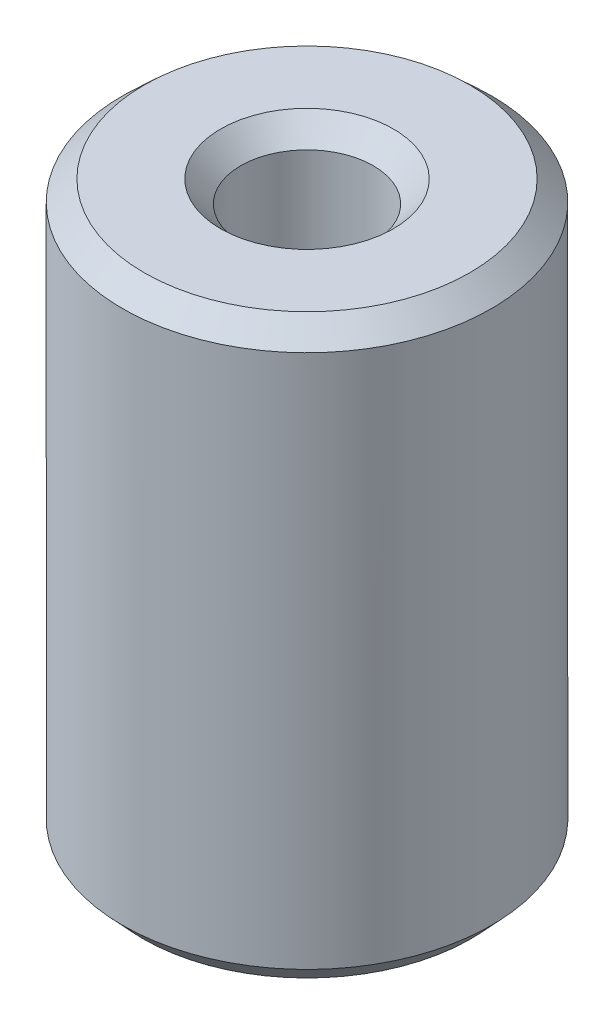
ISO-10303-21;
HEADER;
FILE_DESCRIPTION(('STEP AP214'),'2;1');
FILE_NAME('part.step','',(''),(''),'','','');
FILE_SCHEMA(('AUTOMOTIVE_DESIGN { 1 0 10303 214 1 1 1 1 }'));
ENDSEC;
DATA;
#1=APPLICATION_CONTEXT('core data for automotive mechanical design processes');
#2=APPLICATION_PROTOCOL_DEFINITION('international standard','automotive_design',2000,#1);
#3=PRODUCT_CONTEXT('',#1,'mechanical');
#4=PRODUCT('Part','Part','',(#3));
#5=PRODUCT_RELATED_PRODUCT_CATEGORY('part','',(#4));
#6=PRODUCT_DEFINITION_FORMATION('','',#4);
#7=PRODUCT_DEFINITION_CONTEXT('part definition',#1,'design');
#8=PRODUCT_DEFINITION('design','',#6,#7);
#9=PRODUCT_DEFINITION_SHAPE('','',#8);
#10=(LENGTH_UNIT() NAMED_UNIT(*) SI_UNIT(.MILLI.,.METRE.));
#11=(NAMED_UNIT(*) PLANE_ANGLE_UNIT() SI_UNIT($,.RADIAN.));
#12=(NAMED_UNIT(*) SI_UNIT($,.STERADIAN.) SOLID_ANGLE_UNIT());
#13=UNCERTAINTY_MEASURE_WITH_UNIT(LENGTH_MEASURE(1.E-05),#10,'distance_accuracy_value','');
#14=(GEOMETRIC_REPRESENTATION_CONTEXT(3) GLOBAL_UNCERTAINTY_ASSIGNED_CONTEXT((#13)) GLOBAL_UNIT_ASSIGNED_CONTEXT((#10,
#11,#12)) REPRESENTATION_CONTEXT('',''));
#15=CARTESIAN_POINT('',(0.,0.,0.));
#16=DIRECTION('',(0.,0.,1.));
#17=DIRECTION('',(1.,0.,0.));
#18=AXIS2_PLACEMENT_3D('',#15,#16,#17);
#19=CARTESIAN_POINT('',(0.,46.8487464571703,0.));
#20=DIRECTION('',(0.,-1.,0.));
#21=DIRECTION('',(0.,0.,-1.));
#22=AXIS2_PLACEMENT_3D('',#19,#20,#21);
#23=CYLINDRICAL_SURFACE('',#22,15.);
#24=CARTESIAN_POINT('',(0.,1.76424262891318,0.));
#25=DIRECTION('',(0.,1.,0.));
#26=DIRECTION('',(0.,0.,1.));
#27=AXIS2_PLACEMENT_3D('',#24,#25,#26);
#28=CIRCLE('',#27,15.);
#29=CARTESIAN_POINT('',(0.,1.76424262891318,-15.));
#30=VERTEX_POINT('',#29);
#31=EDGE_CURVE('E10',#30,#30,#28,.T.);
#32=CARTESIAN_POINT('',(0.,45.2051469641876,0.));
#33=DIRECTION('',(0.,1.,0.));
#34=DIRECTION('',(0.,0.,1.));
#35=AXIS2_PLACEMENT_3D('',#32,#33,#34);
#36=CIRCLE('',#35,15.);
#37=CARTESIAN_POINT('',(0.,45.2051469641876,-15.));
#38=VERTEX_POINT('',#37);
#39=EDGE_CURVE('E50',#38,#38,#36,.F.);
#40=CARTESIAN_POINT('',(0.,1.76424262891318,-15.));
#41=CARTESIAN_POINT('',(0.,2.21675204907228,-15.));
#42=CARTESIAN_POINT('',(0.,2.66926146923139,-15.));
#43=CARTESIAN_POINT('',(0.,3.57428030954961,-15.));
#44=CARTESIAN_POINT('',(0.,4.02678972970872,-15.));
#45=CARTESIAN_POINT('',(0.,4.93180857002694,-15.));
#46=CARTESIAN_POINT('',(0.,5.38431799018605,-15.));
#47=CARTESIAN_POINT('',(0.,6.28933683050427,-15.));
#48=CARTESIAN_POINT('',(0.,6.74184625066338,-15.));
#49=CARTESIAN_POINT('',(0.,7.6468650909816,-15.));
#50=CARTESIAN_POINT('',(0.,8.0993745111407,-15.));
#51=CARTESIAN_POINT('',(0.,9.00439335145892,-15.));
#52=CARTESIAN_POINT('',(0.,9.45690277161803,-15.));
#53=CARTESIAN_POINT('',(0.,10.3619216119362,-15.));
#54=CARTESIAN_POINT('',(0.,10.8144310320954,-15.));
#55=CARTESIAN_POINT('',(0.,11.7194498724136,-15.));
#56=CARTESIAN_POINT('',(0.,12.1719592925727,-15.));
#57=CARTESIAN_POINT('',(0.,13.0769781328909,-15.));
#58=CARTESIAN_POINT('',(0.,13.52948755305,-15.));
#59=CARTESIAN_POINT('',(0.,14.4345063933682,-15.));
#60=CARTESIAN_POINT('',(0.,14.8870158135273,-15.));
#61=CARTESIAN_POINT('',(0.,15.7920346538456,-15.));
#62=CARTESIAN_POINT('',(0.,16.2445440740047,-15.));
#63=CARTESIAN_POINT('',(0.,17.1495629143229,-15.));
#64=CARTESIAN_POINT('',(0.,17.602072334482,-15.));
#65=CARTESIAN_POINT('',(0.,18.5070911748002,-15.));
#66=CARTESIAN_POINT('',(0.,18.9596005949593,-15.));
#67=CARTESIAN_POINT('',(0.,19.8646194352775,-15.));
#68=CARTESIAN_POINT('',(0.,20.3171288554366,-15.));
#69=CARTESIAN_POINT('',(0.,21.2221476957549,-15.));
#70=CARTESIAN_POINT('',(0.,21.674657115914,-15.));
#71=CARTESIAN_POINT('',(0.,22.5796759562322,-15.));
#72=CARTESIAN_POINT('',(0.,23.0321853763913,-15.));
#73=CARTESIAN_POINT('',(0.,23.9372042167095,-15.));
#74=CARTESIAN_POINT('',(0.,24.3897136368686,-15.));
#75=CARTESIAN_POINT('',(0.,25.2947324771868,-15.));
#76=CARTESIAN_POINT('',(0.,25.747241897346,-15.));
#77=CARTESIAN_POINT('',(0.,26.6522607376642,-15.));
#78=CARTESIAN_POINT('',(0.,27.1047701578233,-15.));
#79=CARTESIAN_POINT('',(0.,28.0097889981415,-15.));
#80=CARTESIAN_POINT('',(0.,28.4622984183006,-15.));
#81=CARTESIAN_POINT('',(0.,29.3673172586188,-15.));
#82=CARTESIAN_POINT('',(0.,29.8198266787779,-15.));
#83=CARTESIAN_POINT('',(0.,30.7248455190962,-15.));
#84=CARTESIAN_POINT('',(0.,31.1773549392553,-15.));
#85=CARTESIAN_POINT('',(0.,32.0823737795735,-15.));
#86=CARTESIAN_POINT('',(0.,32.5348831997326,-15.));
#87=CARTESIAN_POINT('',(0.,33.4399020400508,-15.));
#88=CARTESIAN_POINT('',(0.,33.8924114602099,-15.));
#89=CARTESIAN_POINT('',(0.,34.7974303005281,-15.));
#90=CARTESIAN_POINT('',(0.,35.2499397206872,-15.));
#91=CARTESIAN_POINT('',(0.,36.1549585610055,-15.));
#92=CARTESIAN_POINT('',(0.,36.6074679811646,-15.));
#93=CARTESIAN_POINT('',(0.,37.5124868214828,-15.));
#94=CARTESIAN_POINT('',(0.,37.9649962416419,-15.));
#95=CARTESIAN_POINT('',(0.,38.8700150819601,-15.));
#96=CARTESIAN_POINT('',(0.,39.3225245021192,-15.));
#97=CARTESIAN_POINT('',(0.,40.2275433424374,-15.));
#98=CARTESIAN_POINT('',(0.,40.6800527625966,-15.));
#99=CARTESIAN_POINT('',(0.,41.5850716029148,-15.));
#100=CARTESIAN_POINT('',(0.,42.0375810230739,-15.));
#101=CARTESIAN_POINT('',(0.,42.9425998633921,-15.));
#102=CARTESIAN_POINT('',(0.,43.3951092835512,-15.));
#103=CARTESIAN_POINT('',(0.,44.3001281238694,-15.));
#104=CARTESIAN_POINT('',(0.,44.7526375440285,-15.));
#105=CARTESIAN_POINT('',(0.,45.2051469641876,-15.));
#106=B_SPLINE_CURVE_WITH_KNOTS('',3,(#40,#41,#42,#43,#44,#45,#46,#47,#48,#49,#50,#51,#52,#53,
#54,#55,#56,#57,#58,#59,#60,#61,#62,#63,#64,#65,#66,#67,#68,#69,#70,#71,#72,#73,#74,#75,#76,#77,
#78,#79,#80,#81,#82,#83,#84,#85,#86,#87,#88,#89,#90,#91,#92,#93,#94,#95,#96,#97,#98,#99,#100,
#101,#102,#103,#104,#105),.UNSPECIFIED.,.F.,.F.,(4,2,2,2,2,2,2,2,2,2,2,2,2,2,2,2,2,2,2,2,2,2,2,
2,2,2,2,2,2,2,2,2,4),(0.,1.35752826047732,2.71505652095465,4.07258478143198,5.43011304190931,
6.78764130238663,8.14516956286396,9.50269782334129,10.8602260838186,12.2177543442959,
13.5752826047733,14.9328108652506,16.2903391257279,17.6478673862052,19.0053956466826,
20.3629239071599,21.7204521676372,23.0779804281146,24.4355086885919,25.7930369490692,
27.1505652095465,28.5080934700239,29.8656217305012,31.2231499909785,32.5806782514558,
33.9382065119332,35.2957347724105,36.6532630328878,38.0107912933652,39.3683195538425,
40.7258478143198,42.0833760747971,43.4409043352745),.UNSPECIFIED.);
#107=EDGE_CURVE('BSEAM39',#30,#38,#106,.T.);
#108=ORIENTED_EDGE('',*,*,#31,.T.);
#109=ORIENTED_EDGE('',*,*,#39,.T.);
#110=ORIENTED_EDGE('',*,*,#107,.T.);
#111=ORIENTED_EDGE('',*,*,#107,.F.);
#112=EDGE_LOOP('',(#108,#110,#109,#111));
#113=FACE_BOUND('',#112,.T.);
#114=ADVANCED_FACE('F39',(#113),#23,.T.);
#115=CARTESIAN_POINT('',(0.,46.8487464571703,0.));
#116=DIRECTION('',(0.,1.,0.));
#117=DIRECTION('',(0.,0.,1.));
#118=AXIS2_PLACEMENT_3D('',#115,#116,#117);
#119=PLANE('',#118);
#120=CARTESIAN_POINT('',(0.,46.8487464571703,0.));
#121=DIRECTION('',(0.,1.,0.));
#122=DIRECTION('',(0.,0.,1.));
#123=AXIS2_PLACEMENT_3D('',#120,#121,#122);
#124=CIRCLE('',#123,7.03169419372547);
#125=CARTESIAN_POINT('',(0.,46.8487464571703,7.03169419372547));
#126=VERTEX_POINT('',#125);
#127=EDGE_CURVE('E58',#126,#126,#124,.F.);
#128=ORIENTED_EDGE('',*,*,#127,.T.);
#129=EDGE_LOOP('',(#128));
#130=FACE_BOUND('',#129,.T.);
#131=CARTESIAN_POINT('',(0.,46.8487464571703,0.));
#132=DIRECTION('',(0.,1.,0.));
#133=DIRECTION('',(0.,0.,1.));
#134=AXIS2_PLACEMENT_3D('',#131,#132,#133);
#135=CIRCLE('',#134,13.2357573710868);
#136=CARTESIAN_POINT('',(0.,46.8487464571703,-13.2357573710868));
#137=VERTEX_POINT('',#136);
#138=EDGE_CURVE('E61',#137,#137,#135,.T.);
#139=ORIENTED_EDGE('',*,*,#138,.T.);
#140=EDGE_LOOP('',(#139));
#141=FACE_BOUND('',#140,.T.);
#142=ADVANCED_FACE('F88',(#130,#141),#119,.T.);
#143=CARTESIAN_POINT('',(0.,0.,0.));
#144=DIRECTION('',(0.,1.,0.));
#145=DIRECTION('',(0.,0.,1.));
#146=AXIS2_PLACEMENT_3D('',#143,#144,#145);
#147=PLANE('',#146);
#148=CARTESIAN_POINT('',(0.,0.,0.));
#149=DIRECTION('',(0.,1.,0.));
#150=DIRECTION('',(0.,0.,1.));
#151=AXIS2_PLACEMENT_3D('',#148,#149,#150);
#152=CIRCLE('',#151,7.15233732965604);
#153=CARTESIAN_POINT('',(0.,0.,-7.15233732965604));
#154=VERTEX_POINT('',#153);
#155=EDGE_CURVE('E51',#154,#154,#152,.T.);
#156=ORIENTED_EDGE('',*,*,#155,.T.);
#157=EDGE_LOOP('',(#156));
#158=FACE_BOUND('',#157,.T.);
#159=CARTESIAN_POINT('',(0.,0.,0.));
#160=DIRECTION('',(0.,1.,0.));
#161=DIRECTION('',(0.,0.,1.));
#162=AXIS2_PLACEMENT_3D('',#159,#160,#161);
#163=CIRCLE('',#162,13.3564005070174);
#164=CARTESIAN_POINT('',(0.,0.,13.3564005070174));
#165=VERTEX_POINT('',#164);
#166=EDGE_CURVE('E54',#165,#165,#163,.F.);
#167=ORIENTED_EDGE('',*,*,#166,.T.);
#168=EDGE_LOOP('',(#167));
#169=FACE_BOUND('',#168,.T.);
#170=ADVANCED_FACE('F83',(#158,#169),#147,.F.);
#171=CARTESIAN_POINT('',(0.,46.8487464571703,0.));
#172=DIRECTION('',(0.,-1.,0.));
#173=DIRECTION('',(0.,0.,-1.));
#174=AXIS2_PLACEMENT_3D('',#171,#172,#173);
#175=CYLINDRICAL_SURFACE('',#174,5.38809470074286);
#176=CARTESIAN_POINT('',(0.,45.0845038282571,0.));
#177=DIRECTION('',(0.,1.,0.));
#178=DIRECTION('',(0.,0.,1.));
#179=AXIS2_PLACEMENT_3D('',#176,#177,#178);
#180=CIRCLE('',#179,5.38809470074286);
#181=CARTESIAN_POINT('',(0.,45.0845038282571,5.38809470074286));
#182=VERTEX_POINT('',#181);
#183=EDGE_CURVE('E67',#182,#182,#180,.T.);
#184=ORIENTED_EDGE('',*,*,#183,.T.);
#185=EDGE_LOOP('',(#184));
#186=FACE_BOUND('',#185,.T.);
#187=CARTESIAN_POINT('',(0.,1.6435994929826,0.));
#188=DIRECTION('',(0.,1.,0.));
#189=DIRECTION('',(0.,0.,1.));
#190=AXIS2_PLACEMENT_3D('',#187,#188,#189);
#191=CIRCLE('',#190,5.38809470074286);
#192=CARTESIAN_POINT('',(0.,1.6435994929826,-5.38809470074286));
#193=VERTEX_POINT('',#192);
#194=EDGE_CURVE('E69',#193,#193,#191,.F.);
#195=ORIENTED_EDGE('',*,*,#194,.T.);
#196=EDGE_LOOP('',(#195));
#197=FACE_BOUND('',#196,.T.);
#198=ADVANCED_FACE('F71',(#186,#197),#175,.F.);
#199=CARTESIAN_POINT('',(0.,45.0845038282571,0.));
#200=DIRECTION('',(0.,1.,0.));
#201=DIRECTION('',(0.,0.,1.));
#202=AXIS2_PLACEMENT_3D('',#199,#200,#201);
#203=CONICAL_SURFACE('',#202,5.38809470074286,0.750011320399669);
#204=ORIENTED_EDGE('',*,*,#127,.F.);
#205=EDGE_LOOP('',(#204));
#206=FACE_BOUND('',#205,.T.);
#207=ORIENTED_EDGE('',*,*,#183,.F.);
#208=EDGE_LOOP('',(#207));
#209=FACE_BOUND('',#208,.T.);
#210=ADVANCED_FACE('F77',(#206,#209),#203,.F.);
#211=CARTESIAN_POINT('',(0.,0.,0.));
#212=DIRECTION('',(0.,-1.,0.));
#213=DIRECTION('',(0.,0.,-1.));
#214=AXIS2_PLACEMENT_3D('',#211,#212,#213);
#215=CONICAL_SURFACE('',#214,7.15233732965604,0.820785006395229);
#216=CARTESIAN_POINT('',(0.,1.6435994929826,-5.38809470074286));
#217=CARTESIAN_POINT('',(0.,1.6264786649307,-5.40647222812738));
#218=CARTESIAN_POINT('',(0.,1.6093578368788,-5.42484975551189));
#219=CARTESIAN_POINT('',(0.,1.57511618077499,-5.46160481028091));
#220=CARTESIAN_POINT('',(0.,1.55799535272309,-5.47998233766543));
#221=CARTESIAN_POINT('',(0.,1.52375369661929,-5.51673739243445));
#222=CARTESIAN_POINT('',(0.,1.50663286856738,-5.53511491981896));
#223=CARTESIAN_POINT('',(0.,1.47239121246358,-5.57186997458799));
#224=CARTESIAN_POINT('',(0.,1.45527038441168,-5.5902475019725));
#225=CARTESIAN_POINT('',(0.,1.42102872830787,-5.62700255674152));
#226=CARTESIAN_POINT('',(0.,1.40390790025597,-5.64538008412604));
#227=CARTESIAN_POINT('',(0.,1.36966624415217,-5.68213513889506));
#228=CARTESIAN_POINT('',(0.,1.35254541610027,-5.70051266627957));
#229=CARTESIAN_POINT('',(0.,1.31830375999646,-5.7372677210486));
#230=CARTESIAN_POINT('',(0.,1.30118293194456,-5.75564524843311));
#231=CARTESIAN_POINT('',(0.,1.26694127584076,-5.79240030320213));
#232=CARTESIAN_POINT('',(0.,1.24982044778885,-5.81077783058665));
#233=CARTESIAN_POINT('',(0.,1.21557879168505,-5.84753288535567));
#234=CARTESIAN_POINT('',(0.,1.19845796363315,-5.86591041274018));
#235=CARTESIAN_POINT('',(0.,1.16421630752934,-5.90266546750921));
#236=CARTESIAN_POINT('',(0.,1.14709547947744,-5.92104299489372));
#237=CARTESIAN_POINT('',(0.,1.11285382337364,-5.95779804966274));
#238=CARTESIAN_POINT('',(0.,1.09573299532173,-5.97617557704726));
#239=CARTESIAN_POINT('',(0.,1.06149133921793,-6.01293063181628));
#240=CARTESIAN_POINT('',(0.,1.04437051116603,-6.03130815920079));
#241=CARTESIAN_POINT('',(0.,1.01012885506222,-6.06806321396982));
#242=CARTESIAN_POINT('',(0.,0.993008027010322,-6.08644074135433));
#243=CARTESIAN_POINT('',(0.,0.958766370906518,-6.12319579612335));
#244=CARTESIAN_POINT('',(0.,0.941645542854616,-6.14157332350787));
#245=CARTESIAN_POINT('',(0.,0.907403886750811,-6.17832837827689));
#246=CARTESIAN_POINT('',(0.,0.890283058698909,-6.1967059056614));
#247=CARTESIAN_POINT('',(0.,0.856041402595105,-6.23346096043043));
#248=CARTESIAN_POINT('',(0.,0.838920574543203,-6.25183848781494));
#249=CARTESIAN_POINT('',(0.,0.804678918439399,-6.28859354258396));
#250=CARTESIAN_POINT('',(0.,0.787558090387496,-6.30697106996848));
#251=CARTESIAN_POINT('',(0.,0.753316434283692,-6.3437261247375));
#252=CARTESIAN_POINT('',(0.,0.73619560623179,-6.36210365212201));
#253=CARTESIAN_POINT('',(0.,0.701953950127986,-6.39885870689104));
#254=CARTESIAN_POINT('',(0.,0.684833122076084,-6.41723623427555));
#255=CARTESIAN_POINT('',(0.,0.65059146597228,-6.45399128904458));
#256=CARTESIAN_POINT('',(0.,0.633470637920378,-6.47236881642909));
#257=CARTESIAN_POINT('',(0.,0.599228981816573,-6.50912387119811));
#258=CARTESIAN_POINT('',(0.,0.582108153764671,-6.52750139858262));
#259=CARTESIAN_POINT('',(0.,0.547866497660867,-6.56425645335165));
#260=CARTESIAN_POINT('',(0.,0.530745669608965,-6.58263398073616));
#261=CARTESIAN_POINT('',(0.,0.496504013505161,-6.61938903550518));
#262=CARTESIAN_POINT('',(0.,0.479383185453259,-6.6377665628897));
#263=CARTESIAN_POINT('',(0.,0.445141529349455,-6.67452161765872));
#264=CARTESIAN_POINT('',(0.,0.428020701297552,-6.69289914504323));
#265=CARTESIAN_POINT('',(0.,0.393779045193748,-6.72965419981226));
#266=CARTESIAN_POINT('',(0.,0.376658217141846,-6.74803172719677));
#267=CARTESIAN_POINT('',(0.,0.342416561038042,-6.78478678196579));
#268=CARTESIAN_POINT('',(0.,0.32529573298614,-6.80316430935031));
#269=CARTESIAN_POINT('',(0.,0.291054076882336,-6.83991936411933));
#270=CARTESIAN_POINT('',(0.,0.273933248830434,-6.85829689150384));
#271=CARTESIAN_POINT('',(0.,0.239691592726629,-6.89505194627287));
#272=CARTESIAN_POINT('',(0.,0.222570764674727,-6.91342947365738));
#273=CARTESIAN_POINT('',(0.,0.188329108570923,-6.9501845284264));
#274=CARTESIAN_POINT('',(0.,0.171208280519021,-6.96856205581092));
#275=CARTESIAN_POINT('',(0.,0.136966624415217,-7.00531711057994));
#276=CARTESIAN_POINT('',(0.,0.119845796363315,-7.02369463796445));
#277=CARTESIAN_POINT('',(0.,0.0856041402595106,-7.06044969273348));
#278=CARTESIAN_POINT('',(0.,0.0684833122076084,-7.07882722011799));
#279=CARTESIAN_POINT('',(0.,0.0342416561038041,-7.11558227488702));
#280=CARTESIAN_POINT('',(0.,0.017120828051902,-7.13395980227153));
#281=CARTESIAN_POINT('',(0.,0.,-7.15233732965604));
#282=B_SPLINE_CURVE_WITH_KNOTS('',3,(#216,#217,#218,#219,#220,#221,#222,#223,#224,#225,#226,
#227,#228,#229,#230,#231,#232,#233,#234,#235,#236,#237,#238,#239,#240,#241,#242,#243,#244,#245,
#246,#247,#248,#249,#250,#251,#252,#253,#254,#255,#256,#257,#258,#259,#260,#261,#262,#263,#264,
#265,#266,#267,#268,#269,#270,#271,#272,#273,#274,#275,#276,#277,#278,#279,#280,#281),
.UNSPECIFIED.,.F.,.F.,(4,2,2,2,2,2,2,2,2,2,2,2,2,2,2,2,2,2,2,2,2,2,2,2,2,2,2,2,2,2,2,2,4),(0.,
0.0753505566904561,0.150701113380913,0.226051670071369,0.301402226761825,0.376752783452281,
0.452103340142738,0.527453896833194,0.60280445352365,0.678155010214106,0.753505566904563,
0.828856123595019,0.904206680285475,0.979557236975932,1.05490779366639,1.13025835035684,
1.2056089070473,1.28095946373776,1.35631002042821,1.43166057711867,1.50701113380913,
1.58236169049958,1.65771224719004,1.73306280388049,1.80841336057095,1.88376391726141,
1.95911447395186,2.03446503064232,2.10981558733278,2.18516614402323,2.26051670071369,
2.33586725740414,2.4112178140946),.UNSPECIFIED.);
#283=EDGE_CURVE('BSEAM73',#193,#154,#282,.T.);
#284=ORIENTED_EDGE('',*,*,#194,.F.);
#285=ORIENTED_EDGE('',*,*,#155,.F.);
#286=ORIENTED_EDGE('',*,*,#283,.T.);
#287=ORIENTED_EDGE('',*,*,#283,.F.);
#288=EDGE_LOOP('',(#284,#286,#285,#287));
#289=FACE_BOUND('',#288,.T.);
#290=ADVANCED_FACE('F73',(#289),#215,.F.);
#291=CARTESIAN_POINT('',(0.,1.76424262891318,0.));
#292=DIRECTION('',(0.,1.,0.));
#293=DIRECTION('',(0.,0.,1.));
#294=AXIS2_PLACEMENT_3D('',#291,#292,#293);
#295=CONICAL_SURFACE('',#294,15.,0.750011320399669);
#296=ORIENTED_EDGE('',*,*,#166,.F.);
#297=EDGE_LOOP('',(#296));
#298=FACE_BOUND('',#297,.T.);
#299=ORIENTED_EDGE('',*,*,#31,.F.);
#300=EDGE_LOOP('',(#299));
#301=FACE_BOUND('',#300,.T.);
#302=ADVANCED_FACE('F76',(#298,#301),#295,.T.);
#303=CARTESIAN_POINT('',(0.,46.8487464571703,0.));
#304=DIRECTION('',(0.,-1.,0.));
#305=DIRECTION('',(0.,0.,-1.));
#306=AXIS2_PLACEMENT_3D('',#303,#304,#305);
#307=CONICAL_SURFACE('',#306,13.2357573710868,0.820785006395227);
#308=CARTESIAN_POINT('',(0.,45.2051469641876,-15.));
#309=CARTESIAN_POINT('',(0.,45.2222677922395,-14.9816224726155));
#310=CARTESIAN_POINT('',(0.,45.2393886202914,-14.963244945231));
#311=CARTESIAN_POINT('',(0.,45.2736302763952,-14.926489890462));
#312=CARTESIAN_POINT('',(0.,45.2907511044471,-14.9081123630774));
#313=CARTESIAN_POINT('',(0.,45.3249927605509,-14.8713573083084));
#314=CARTESIAN_POINT('',(0.,45.3421135886029,-14.8529797809239));
#315=CARTESIAN_POINT('',(0.,45.3763552447067,-14.8162247261549));
#316=CARTESIAN_POINT('',(0.,45.3934760727586,-14.7978471987704));
#317=CARTESIAN_POINT('',(0.,45.4277177288624,-14.7610921440013));
#318=CARTESIAN_POINT('',(0.,45.4448385569143,-14.7427146166168));
#319=CARTESIAN_POINT('',(0.,45.4790802130181,-14.7059595618478));
#320=CARTESIAN_POINT('',(0.,45.49620104107,-14.6875820344633));
#321=CARTESIAN_POINT('',(0.,45.5304426971738,-14.6508269796943));
#322=CARTESIAN_POINT('',(0.,45.5475635252257,-14.6324494523098));
#323=CARTESIAN_POINT('',(0.,45.5818051813295,-14.5956943975407));
#324=CARTESIAN_POINT('',(0.,45.5989260093814,-14.5773168701562));
#325=CARTESIAN_POINT('',(0.,45.6331676654852,-14.5405618153872));
#326=CARTESIAN_POINT('',(0.,45.6502884935371,-14.5221842880027));
#327=CARTESIAN_POINT('',(0.,45.6845301496409,-14.4854292332337));
#328=CARTESIAN_POINT('',(0.,45.7016509776928,-14.4670517058491));
#329=CARTESIAN_POINT('',(0.,45.7358926337966,-14.4302966510801));
#330=CARTESIAN_POINT('',(0.,45.7530134618485,-14.4119191236956));
#331=CARTESIAN_POINT('',(0.,45.7872551179523,-14.3751640689266));
#332=CARTESIAN_POINT('',(0.,45.8043759460042,-14.3567865415421));
#333=CARTESIAN_POINT('',(0.,45.838617602108,-14.320031486773));
#334=CARTESIAN_POINT('',(0.,45.8557384301599,-14.3016539593885));
#335=CARTESIAN_POINT('',(0.,45.8899800862637,-14.2648989046195));
#336=CARTESIAN_POINT('',(0.,45.9071009143156,-14.246521377235));
#337=CARTESIAN_POINT('',(0.,45.9413425704194,-14.209766322466));
#338=CARTESIAN_POINT('',(0.,45.9584633984714,-14.1913887950815));
#339=CARTESIAN_POINT('',(0.,45.9927050545752,-14.1546337403124));
#340=CARTESIAN_POINT('',(0.,46.0098258826271,-14.1362562129279));
#341=CARTESIAN_POINT('',(0.,46.0440675387309,-14.0995011581589));
#342=CARTESIAN_POINT('',(0.,46.0611883667828,-14.0811236307744));
#343=CARTESIAN_POINT('',(0.,46.0954300228866,-14.0443685760054));
#344=CARTESIAN_POINT('',(0.,46.1125508509385,-14.0259910486208));
#345=CARTESIAN_POINT('',(0.,46.1467925070423,-13.9892359938518));
#346=CARTESIAN_POINT('',(0.,46.1639133350942,-13.9708584664673));
#347=CARTESIAN_POINT('',(0.,46.198154991198,-13.9341034116983));
#348=CARTESIAN_POINT('',(0.,46.2152758192499,-13.9157258843138));
#349=CARTESIAN_POINT('',(0.,46.2495174753537,-13.8789708295447));
#350=CARTESIAN_POINT('',(0.,46.2666383034056,-13.8605933021602));
#351=CARTESIAN_POINT('',(0.,46.3008799595094,-13.8238382473912));
#352=CARTESIAN_POINT('',(0.,46.3180007875613,-13.8054607200067));
#353=CARTESIAN_POINT('',(0.,46.3522424436651,-13.7687056652377));
#354=CARTESIAN_POINT('',(0.,46.369363271717,-13.7503281378532));
#355=CARTESIAN_POINT('',(0.,46.4036049278208,-13.7135730830841));
#356=CARTESIAN_POINT('',(0.,46.4207257558727,-13.6951955556996));
#357=CARTESIAN_POINT('',(0.,46.4549674119765,-13.6584405009306));
#358=CARTESIAN_POINT('',(0.,46.4720882400284,-13.6400629735461));
#359=CARTESIAN_POINT('',(0.,46.5063298961322,-13.6033079187771));
#360=CARTESIAN_POINT('',(0.,46.5234507241841,-13.5849303913925));
#361=CARTESIAN_POINT('',(0.,46.5576923802879,-13.5481753366235));
#362=CARTESIAN_POINT('',(0.,46.5748132083398,-13.529797809239));
#363=CARTESIAN_POINT('',(0.,46.6090548644436,-13.49304275447));
#364=CARTESIAN_POINT('',(0.,46.6261756924955,-13.4746652270855));
#365=CARTESIAN_POINT('',(0.,46.6604173485993,-13.4379101723164));
#366=CARTESIAN_POINT('',(0.,46.6775381766513,-13.4195326449319));
#367=CARTESIAN_POINT('',(0.,46.7117798327551,-13.3827775901629));
#368=CARTESIAN_POINT('',(0.,46.728900660807,-13.3644000627784));
#369=CARTESIAN_POINT('',(0.,46.7631423169108,-13.3276450080094));
#370=CARTESIAN_POINT('',(0.,46.7802631449627,-13.3092674806248));
#371=CARTESIAN_POINT('',(0.,46.8145048010665,-13.2725124258558));
#372=CARTESIAN_POINT('',(0.,46.8316256291184,-13.2541348984713));
#373=CARTESIAN_POINT('',(0.,46.8487464571703,-13.2357573710868));
#374=B_SPLINE_CURVE_WITH_KNOTS('',3,(#308,#309,#310,#311,#312,#313,#314,#315,#316,#317,#318,
#319,#320,#321,#322,#323,#324,#325,#326,#327,#328,#329,#330,#331,#332,#333,#334,#335,#336,#337,
#338,#339,#340,#341,#342,#343,#344,#345,#346,#347,#348,#349,#350,#351,#352,#353,#354,#355,#356,
#357,#358,#359,#360,#361,#362,#363,#364,#365,#366,#367,#368,#369,#370,#371,#372,#373),
.UNSPECIFIED.,.F.,.F.,(4,2,2,2,2,2,2,2,2,2,2,2,2,2,2,2,2,2,2,2,2,2,2,2,2,2,2,2,2,2,2,2,4),(0.,
0.0753505566904524,0.150701113380911,0.226051670071369,0.301402226761826,0.376752783452285,
0.452103340142743,0.5274538968332,0.602804453523659,0.678155010214116,0.753505566904574,
0.828856123595033,0.90420668028549,0.979557236975948,1.05490779366641,1.13025835035686,
1.20560890704732,1.28095946373777,1.35631002042823,1.43166057711869,1.50701113380915,
1.58236169049961,1.65771224719007,1.73306280388052,1.80841336057098,1.88376391726144,
1.9591144739519,2.03446503064236,2.10981558733281,2.18516614402327,2.26051670071373,
2.33586725740419,2.41121781409465),.UNSPECIFIED.);
#375=EDGE_CURVE('BSEAM45',#38,#137,#374,.T.);
#376=ORIENTED_EDGE('',*,*,#39,.F.);
#377=ORIENTED_EDGE('',*,*,#138,.F.);
#378=ORIENTED_EDGE('',*,*,#375,.T.);
#379=ORIENTED_EDGE('',*,*,#375,.F.);
#380=EDGE_LOOP('',(#376,#378,#377,#379));
#381=FACE_BOUND('',#380,.T.);
#382=ADVANCED_FACE('F45',(#381),#307,.T.);
#383=CLOSED_SHELL('',(#114,#142,#170,#198,#210,#290,#302,#382));
#384=MANIFOLD_SOLID_BREP('B2',#383);
#385=ADVANCED_BREP_SHAPE_REPRESENTATION('',(#18,#384),#14);
#386=SHAPE_DEFINITION_REPRESENTATION(#9,#385);
ENDSEC;
END-ISO-10303-21;
